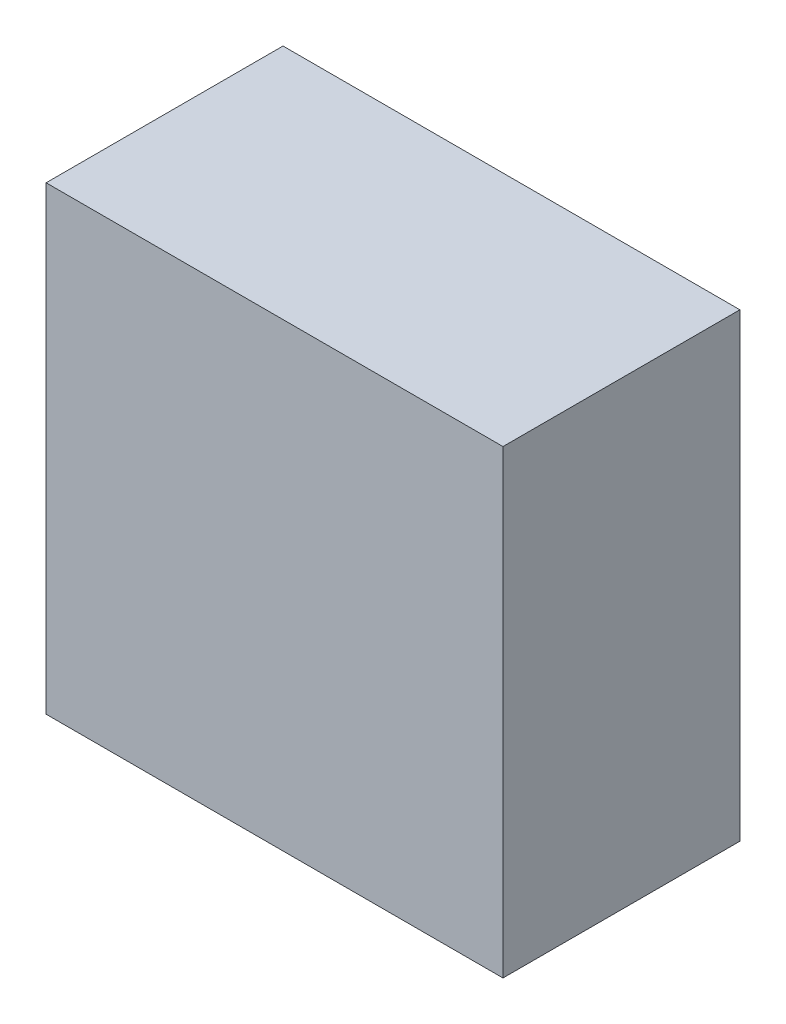
ISO-10303-21;
HEADER;
FILE_DESCRIPTION(('STEP AP214'),'2;1');
FILE_NAME('part.step','',(''),(''),'','','');
FILE_SCHEMA(('AUTOMOTIVE_DESIGN { 1 0 10303 214 1 1 1 1 }'));
ENDSEC;
DATA;
#1=APPLICATION_CONTEXT('core data for automotive mechanical design processes');
#2=APPLICATION_PROTOCOL_DEFINITION('international standard','automotive_design',2000,#1);
#3=PRODUCT_CONTEXT('',#1,'mechanical');
#4=PRODUCT('Part','Part','',(#3));
#5=PRODUCT_RELATED_PRODUCT_CATEGORY('part','',(#4));
#6=PRODUCT_DEFINITION_FORMATION('','',#4);
#7=PRODUCT_DEFINITION_CONTEXT('part definition',#1,'design');
#8=PRODUCT_DEFINITION('design','',#6,#7);
#9=PRODUCT_DEFINITION_SHAPE('','',#8);
#10=(LENGTH_UNIT() NAMED_UNIT(*) SI_UNIT(.MILLI.,.METRE.));
#11=(NAMED_UNIT(*) PLANE_ANGLE_UNIT() SI_UNIT($,.RADIAN.));
#12=(NAMED_UNIT(*) SI_UNIT($,.STERADIAN.) SOLID_ANGLE_UNIT());
#13=UNCERTAINTY_MEASURE_WITH_UNIT(LENGTH_MEASURE(1.E-05),#10,'distance_accuracy_value','');
#14=(GEOMETRIC_REPRESENTATION_CONTEXT(3) GLOBAL_UNCERTAINTY_ASSIGNED_CONTEXT((#13)) GLOBAL_UNIT_ASSIGNED_CONTEXT((#10,
#11,#12)) REPRESENTATION_CONTEXT('',''));
#15=CARTESIAN_POINT('',(0.,0.,0.));
#16=DIRECTION('',(0.,0.,1.));
#17=DIRECTION('',(1.,0.,0.));
#18=AXIS2_PLACEMENT_3D('',#15,#16,#17);
#19=CARTESIAN_POINT('',(0.67499992,-0.67999864,0.));
#20=DIRECTION('',(1.88148170224543E-06,-0.99999999999823,0.));
#21=DIRECTION('',(-0.99999999999823,-1.88148170224543E-06,0.));
#22=AXIS2_PLACEMENT_3D('',#19,#20,#21);
#23=PLANE('',#22);
#24=DIRECTION('',(0.,0.,1.));
#25=VECTOR('',#24,1.);
#26=CARTESIAN_POINT('',(0.67499992,-0.67999864,0.));
#27=LINE('',#26,#25);
#28=CARTESIAN_POINT('',(0.67499992,-0.67999864,0.));
#29=VERTEX_POINT('',#28);
#30=CARTESIAN_POINT('',(0.67499992,-0.67999864,0.70000114));
#31=VERTEX_POINT('',#30);
#32=EDGE_CURVE('E11',#29,#31,#27,.T.);
#33=ORIENTED_EDGE('',*,*,#32,.T.);
#34=DIRECTION('',(-0.99999999999823,-1.88148170224543E-06,0.));
#35=VECTOR('',#34,1.);
#36=CARTESIAN_POINT('',(0.67499992,-0.67999864,0.70000114));
#37=LINE('',#36,#35);
#38=CARTESIAN_POINT('',(-0.67499992,-0.68000118,0.70000114));
#39=VERTEX_POINT('',#38);
#40=EDGE_CURVE('E23',#31,#39,#37,.T.);
#41=ORIENTED_EDGE('',*,*,#40,.T.);
#42=DIRECTION('',(0.,0.,1.));
#43=VECTOR('',#42,1.);
#44=CARTESIAN_POINT('',(-0.67499992,-0.68000118,0.));
#45=LINE('',#44,#43);
#46=CARTESIAN_POINT('',(-0.67499992,-0.68000118,0.));
#47=VERTEX_POINT('',#46);
#48=EDGE_CURVE('E84',#47,#39,#45,.T.);
#49=ORIENTED_EDGE('',*,*,#48,.F.);
#50=DIRECTION('',(-0.99999999999823,-1.88148170224543E-06,0.));
#51=VECTOR('',#50,1.);
#52=CARTESIAN_POINT('',(0.67499992,-0.67999864,0.));
#53=LINE('',#52,#51);
#54=EDGE_CURVE('E82',#29,#47,#53,.T.);
#55=ORIENTED_EDGE('',*,*,#54,.F.);
#56=EDGE_LOOP('',(#33,#41,#49,#55));
#57=FACE_BOUND('',#56,.T.);
#58=ADVANCED_FACE('F16',(#57),#23,.T.);
#59=CARTESIAN_POINT('',(-0.67499992,-0.68000118,0.));
#60=DIRECTION('',(-1.,0.,0.));
#61=DIRECTION('',(0.,1.,0.));
#62=AXIS2_PLACEMENT_3D('',#59,#60,#61);
#63=PLANE('',#62);
#64=ORIENTED_EDGE('',*,*,#48,.T.);
#65=DIRECTION('',(0.,1.,0.));
#66=VECTOR('',#65,1.);
#67=CARTESIAN_POINT('',(-0.67499992,-0.68000118,0.70000114));
#68=LINE('',#67,#66);
#69=CARTESIAN_POINT('',(-0.67499992,0.68000118,0.70000114));
#70=VERTEX_POINT('',#69);
#71=EDGE_CURVE('E80',#39,#70,#68,.T.);
#72=ORIENTED_EDGE('',*,*,#71,.T.);
#73=DIRECTION('',(0.,0.,1.));
#74=VECTOR('',#73,1.);
#75=CARTESIAN_POINT('',(-0.67499992,0.68000118,0.));
#76=LINE('',#75,#74);
#77=CARTESIAN_POINT('',(-0.67499992,0.68000118,0.));
#78=VERTEX_POINT('',#77);
#79=EDGE_CURVE('E78',#78,#70,#76,.T.);
#80=ORIENTED_EDGE('',*,*,#79,.F.);
#81=DIRECTION('',(0.,1.,0.));
#82=VECTOR('',#81,1.);
#83=CARTESIAN_POINT('',(-0.67499992,-0.68000118,0.));
#84=LINE('',#83,#82);
#85=EDGE_CURVE('E69',#47,#78,#84,.T.);
#86=ORIENTED_EDGE('',*,*,#85,.F.);
#87=EDGE_LOOP('',(#64,#72,#80,#86));
#88=FACE_BOUND('',#87,.T.);
#89=ADVANCED_FACE('F89',(#88),#63,.T.);
#90=CARTESIAN_POINT('',(-0.67499992,0.68000118,0.));
#91=DIRECTION('',(-1.88148170224543E-06,0.99999999999823,0.));
#92=DIRECTION('',(0.99999999999823,1.88148170224543E-06,0.));
#93=AXIS2_PLACEMENT_3D('',#90,#91,#92);
#94=PLANE('',#93);
#95=ORIENTED_EDGE('',*,*,#79,.T.);
#96=DIRECTION('',(0.99999999999823,1.88148170224543E-06,0.));
#97=VECTOR('',#96,1.);
#98=CARTESIAN_POINT('',(-0.67499992,0.68000118,0.70000114));
#99=LINE('',#98,#97);
#100=CARTESIAN_POINT('',(0.67499992,0.68000372,0.70000114));
#101=VERTEX_POINT('',#100);
#102=EDGE_CURVE('E59',#70,#101,#99,.T.);
#103=ORIENTED_EDGE('',*,*,#102,.T.);
#104=DIRECTION('',(0.,0.,1.));
#105=VECTOR('',#104,1.);
#106=CARTESIAN_POINT('',(0.67499992,0.68000372,0.));
#107=LINE('',#106,#105);
#108=CARTESIAN_POINT('',(0.67499992,0.68000372,0.));
#109=VERTEX_POINT('',#108);
#110=EDGE_CURVE('E53',#109,#101,#107,.T.);
#111=ORIENTED_EDGE('',*,*,#110,.F.);
#112=DIRECTION('',(0.99999999999823,1.88148170224543E-06,0.));
#113=VECTOR('',#112,1.);
#114=CARTESIAN_POINT('',(-0.67499992,0.68000118,0.));
#115=LINE('',#114,#113);
#116=EDGE_CURVE('E57',#78,#109,#115,.T.);
#117=ORIENTED_EDGE('',*,*,#116,.F.);
#118=EDGE_LOOP('',(#95,#103,#111,#117));
#119=FACE_BOUND('',#118,.T.);
#120=ADVANCED_FACE('F56',(#119),#94,.T.);
#121=CARTESIAN_POINT('',(0.67499992,0.68000372,0.));
#122=DIRECTION('',(1.,0.,0.));
#123=DIRECTION('',(0.,-1.,0.));
#124=AXIS2_PLACEMENT_3D('',#121,#122,#123);
#125=PLANE('',#124);
#126=ORIENTED_EDGE('',*,*,#110,.T.);
#127=DIRECTION('',(0.,-1.,0.));
#128=VECTOR('',#127,1.);
#129=CARTESIAN_POINT('',(0.67499992,0.68000372,0.70000114));
#130=LINE('',#129,#128);
#131=EDGE_CURVE('E70',#101,#31,#130,.T.);
#132=ORIENTED_EDGE('',*,*,#131,.T.);
#133=ORIENTED_EDGE('',*,*,#32,.F.);
#134=DIRECTION('',(0.,-1.,0.));
#135=VECTOR('',#134,1.);
#136=CARTESIAN_POINT('',(0.67499992,0.68000372,0.));
#137=LINE('',#136,#135);
#138=EDGE_CURVE('E67',#109,#29,#137,.T.);
#139=ORIENTED_EDGE('',*,*,#138,.F.);
#140=EDGE_LOOP('',(#126,#132,#133,#139));
#141=FACE_BOUND('',#140,.T.);
#142=ADVANCED_FACE('F72',(#141),#125,.T.);
#143=CARTESIAN_POINT('',(0.67499992,-0.67999864,0.));
#144=DIRECTION('',(0.,0.,1.));
#145=DIRECTION('',(1.,0.,0.));
#146=AXIS2_PLACEMENT_3D('',#143,#144,#145);
#147=PLANE('',#146);
#148=ORIENTED_EDGE('',*,*,#54,.T.);
#149=ORIENTED_EDGE('',*,*,#85,.T.);
#150=ORIENTED_EDGE('',*,*,#116,.T.);
#151=ORIENTED_EDGE('',*,*,#138,.T.);
#152=EDGE_LOOP('',(#148,#149,#150,#151));
#153=FACE_BOUND('',#152,.T.);
#154=ADVANCED_FACE('F66',(#153),#147,.F.);
#155=CARTESIAN_POINT('',(0.67499992,-0.67999864,0.70000114));
#156=DIRECTION('',(0.,0.,1.));
#157=DIRECTION('',(1.,0.,0.));
#158=AXIS2_PLACEMENT_3D('',#155,#156,#157);
#159=PLANE('',#158);
#160=ORIENTED_EDGE('',*,*,#131,.F.);
#161=ORIENTED_EDGE('',*,*,#102,.F.);
#162=ORIENTED_EDGE('',*,*,#71,.F.);
#163=ORIENTED_EDGE('',*,*,#40,.F.);
#164=EDGE_LOOP('',(#160,#161,#162,#163));
#165=FACE_BOUND('',#164,.T.);
#166=ADVANCED_FACE('F90',(#165),#159,.T.);
#167=CLOSED_SHELL('',(#58,#89,#120,#142,#154,#166));
#168=MANIFOLD_SOLID_BREP('B1',#167);
#169=ADVANCED_BREP_SHAPE_REPRESENTATION('',(#18,#168),#14);
#170=SHAPE_DEFINITION_REPRESENTATION(#9,#169);
ENDSEC;
END-ISO-10303-21;
